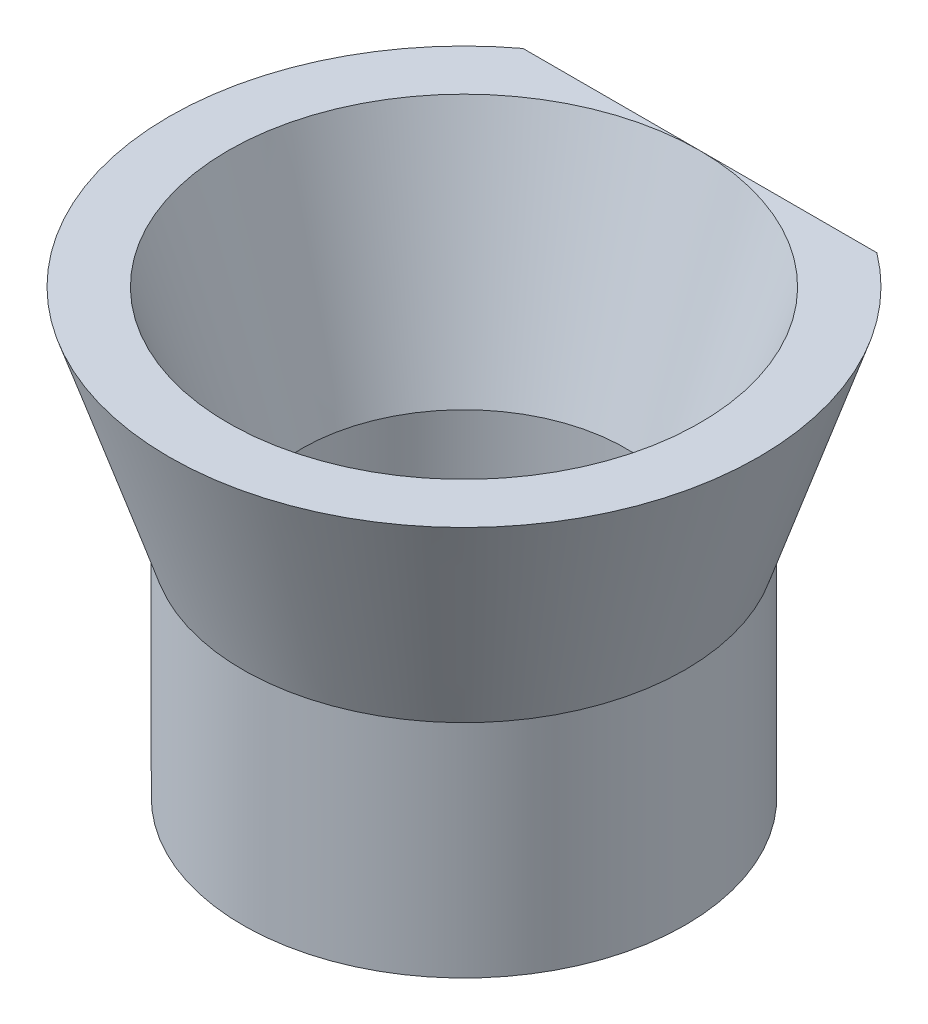
ISO-10303-21;
HEADER;
FILE_DESCRIPTION(('STEP AP214'),'2;1');
FILE_NAME('part.step','',(''),(''),'','','');
FILE_SCHEMA(('AUTOMOTIVE_DESIGN { 1 0 10303 214 1 1 1 1 }'));
ENDSEC;
DATA;
#1=APPLICATION_CONTEXT('core data for automotive mechanical design processes');
#2=APPLICATION_PROTOCOL_DEFINITION('international standard','automotive_design',2000,#1);
#3=PRODUCT_CONTEXT('',#1,'mechanical');
#4=PRODUCT('Part','Part','',(#3));
#5=PRODUCT_RELATED_PRODUCT_CATEGORY('part','',(#4));
#6=PRODUCT_DEFINITION_FORMATION('','',#4);
#7=PRODUCT_DEFINITION_CONTEXT('part definition',#1,'design');
#8=PRODUCT_DEFINITION('design','',#6,#7);
#9=PRODUCT_DEFINITION_SHAPE('','',#8);
#10=(LENGTH_UNIT() NAMED_UNIT(*) SI_UNIT(.MILLI.,.METRE.));
#11=(NAMED_UNIT(*) PLANE_ANGLE_UNIT() SI_UNIT($,.RADIAN.));
#12=(NAMED_UNIT(*) SI_UNIT($,.STERADIAN.) SOLID_ANGLE_UNIT());
#13=UNCERTAINTY_MEASURE_WITH_UNIT(LENGTH_MEASURE(1.E-05),#10,'distance_accuracy_value','');
#14=(GEOMETRIC_REPRESENTATION_CONTEXT(3) GLOBAL_UNCERTAINTY_ASSIGNED_CONTEXT((#13)) GLOBAL_UNIT_ASSIGNED_CONTEXT((#10,
#11,#12)) REPRESENTATION_CONTEXT('',''));
#15=CARTESIAN_POINT('',(0.,0.,0.));
#16=DIRECTION('',(0.,0.,1.));
#17=DIRECTION('',(1.,0.,0.));
#18=AXIS2_PLACEMENT_3D('',#15,#16,#17);
#19=CARTESIAN_POINT('',(0.,7.5,0.));
#20=DIRECTION('',(0.,1.,0.));
#21=DIRECTION('',(-1.,0.,0.));
#22=AXIS2_PLACEMENT_3D('',#19,#20,#21);
#23=CONICAL_SURFACE('',#22,10.,0.321750554396642);
#24=CARTESIAN_POINT('',(-9.24454303567789,14.1763436488223,-8.));
#25=CARTESIAN_POINT('',(-9.10569477276953,13.8613954725508,-8.));
#26=CARTESIAN_POINT('',(-8.96574609865972,13.5469287509722,-8.));
#27=CARTESIAN_POINT('',(-8.68329380641064,12.9191295276742,-8.));
#28=CARTESIAN_POINT('',(-8.54079008119043,12.6057970741559,-8.));
#29=CARTESIAN_POINT('',(-8.2526980260246,11.980057705734,-8.));
#30=CARTESIAN_POINT('',(-8.10710592677667,11.6676525236571,-8.));
#31=CARTESIAN_POINT('',(-7.81257371012224,11.0444276218861,-8.));
#32=CARTESIAN_POINT('',(-7.6636336387795,10.7336078804504,-8.));
#33=CARTESIAN_POINT('',(-7.35832769249353,10.1066065651362,-8.));
#34=CARTESIAN_POINT('',(-7.2018696027832,9.79046980971064,-8.));
#35=CARTESIAN_POINT('',(-6.88414504074487,9.16062304097392,-8.));
#36=CARTESIAN_POINT('',(-6.72287865045157,8.84691298637559,-8.));
#37=CARTESIAN_POINT('',(-6.39468770628505,8.22268443592128,-8.));
#38=CARTESIAN_POINT('',(-6.22776639834812,7.91216423814771,-8.));
#39=CARTESIAN_POINT('',(-5.88696278138132,7.29497792699961,-8.));
#40=CARTESIAN_POINT('',(-5.71308093553065,6.98831155895585,-8.));
#41=CARTESIAN_POINT('',(-5.35432333661414,6.37594889211449,-8.));
#42=CARTESIAN_POINT('',(-5.16933183563973,6.07032015376405,-8.));
#43=CARTESIAN_POINT('',(-4.78804370061161,5.46589785851707,-8.));
#44=CARTESIAN_POINT('',(-4.5917413865298,5.16710784296969,-8.));
#45=CARTESIAN_POINT('',(-4.28674636930607,4.72710391499398,-8.));
#46=CARTESIAN_POINT('',(-4.1835427470974,4.58208325643538,-8.));
#47=CARTESIAN_POINT('',(-3.97294022781535,4.29512835185492,-8.));
#48=CARTESIAN_POINT('',(-3.86554172478353,4.15319381788171,-8.));
#49=CARTESIAN_POINT('',(-3.64595793579181,3.87324906006634,-8.));
#50=CARTESIAN_POINT('',(-3.53377661025079,3.73523574122914,-8.));
#51=CARTESIAN_POINT('',(-3.30374029436852,3.46404334126958,-8.));
#52=CARTESIAN_POINT('',(-3.1858866240236,3.33086314797535,-8.));
#53=CARTESIAN_POINT('',(-2.96323190356762,3.09191235624022,-8.));
#54=CARTESIAN_POINT('',(-2.85943295784345,2.9852114662485,-8.));
#55=CARTESIAN_POINT('',(-2.64642192748903,2.77727411204413,-8.));
#56=CARTESIAN_POINT('',(-2.53720869788133,2.67603881319632,-8.));
#57=CARTESIAN_POINT('',(-2.31280525663956,2.48075252932649,-8.));
#58=CARTESIAN_POINT('',(-2.19762543900272,2.38668971246759,-8.));
#59=CARTESIAN_POINT('',(-1.96042227625798,2.20770762245108,-8.));
#60=CARTESIAN_POINT('',(-1.83840290507046,2.12278312180526,-8.));
#61=CARTESIAN_POINT('',(-1.5558966618511,1.94536491447872,-8.));
#62=CARTESIAN_POINT('',(-1.3933145495631,1.8561224577266,-8.));
#63=CARTESIAN_POINT('',(-1.05649022012242,1.70326267655866,-8.));
#64=CARTESIAN_POINT('',(-0.882270892839967,1.63959668027351,-8.));
#65=CARTESIAN_POINT('',(-0.554345281722239,1.55342085810759,-8.));
#66=CARTESIAN_POINT('',(-0.401995129495038,1.5258548449162,-8.));
#67=CARTESIAN_POINT('',(-0.0948068607246134,1.49727821843598,-8.));
#68=CARTESIAN_POINT('',(0.0600299395169995,1.49625399066451,-8.));
#69=CARTESIAN_POINT('',(0.367303142382071,1.5208629840155,-8.));
#70=CARTESIAN_POINT('',(0.51974234350439,1.54646235541336,-8.));
#71=CARTESIAN_POINT('',(0.818631422466707,1.6211740628739,-8.));
#72=CARTESIAN_POINT('',(0.96507738250549,1.67030152100824,-8.));
#73=CARTESIAN_POINT('',(1.32953022972107,1.82022121071207,-8.));
#74=CARTESIAN_POINT('',(1.54193510338091,1.93454807823632,-8.));
#75=CARTESIAN_POINT('',(1.84567955273147,2.12864263840525,-8.));
#76=CARTESIAN_POINT('',(1.94465324288413,2.19728556141693,-8.));
#77=CARTESIAN_POINT('',(2.13804565733174,2.3407389514385,-8.));
#78=CARTESIAN_POINT('',(2.23246523898747,2.4155482503201,-8.));
#79=CARTESIAN_POINT('',(2.44925759013744,2.59703077177536,-8.));
#80=CARTESIAN_POINT('',(2.56992011587711,2.70573113445258,-8.));
#81=CARTESIAN_POINT('',(2.80470570648837,2.93002129920439,-8.));
#82=CARTESIAN_POINT('',(2.91882577723235,3.04561420702878,-8.));
#83=CARTESIAN_POINT('',(3.14157446411835,3.28231249538075,-8.));
#84=CARTESIAN_POINT('',(3.25019350422911,3.40342683528697,-8.));
#85=CARTESIAN_POINT('',(3.46253605350942,3.64987894818479,-8.));
#86=CARTESIAN_POINT('',(3.56625895704296,3.77521724039598,-8.));
#87=CARTESIAN_POINT('',(3.77072633037294,4.0308635305577,-8.));
#88=CARTESIAN_POINT('',(3.87141745814981,4.16121403433047,-8.));
#89=CARTESIAN_POINT('',(4.06902124255324,4.42474588789625,-8.));
#90=CARTESIAN_POINT('',(4.16593377228471,4.5579273325279,-8.));
#91=CARTESIAN_POINT('',(4.35634109091726,4.82646858707353,-8.));
#92=CARTESIAN_POINT('',(4.44983979692935,4.96182562612383,-8.));
#93=CARTESIAN_POINT('',(4.63392697300001,5.23449099315925,-8.));
#94=CARTESIAN_POINT('',(4.72451555687136,5.37179924453019,-8.));
#95=CARTESIAN_POINT('',(5.02283771914524,5.83320152344906,-8.));
#96=CARTESIAN_POINT('',(5.22485610260052,6.16099650651995,-8.));
#97=CARTESIAN_POINT('',(5.6181730171291,6.82297994202042,-8.));
#98=CARTESIAN_POINT('',(5.80946932793764,7.15716969956537,-8.));
#99=CARTESIAN_POINT('',(6.18366838310789,7.83048044152699,-8.));
#100=CARTESIAN_POINT('',(6.36656569032789,8.16960443821652,-8.));
#101=CARTESIAN_POINT('',(6.72547874559801,8.85147784372403,-8.));
#102=CARTESIAN_POINT('',(6.90149421320207,9.19422739956773,-8.));
#103=CARTESIAN_POINT('',(7.24844897335354,9.88375656077994,-8.));
#104=CARTESIAN_POINT('',(7.41936873405891,10.2305459700732,-8.));
#105=CARTESIAN_POINT('',(7.75643942813245,10.9264368840752,-8.));
#106=CARTESIAN_POINT('',(7.9225902814056,11.2755384274959,-8.));
#107=CARTESIAN_POINT('',(8.25078773713447,11.975493863186,-8.));
#108=CARTESIAN_POINT('',(8.41283593898465,12.3263470066957,-8.));
#109=CARTESIAN_POINT('',(8.73347450690632,13.0296311128299,-8.));
#110=CARTESIAN_POINT('',(8.89206484099753,13.3820620900107,-8.));
#111=CARTESIAN_POINT('',(9.32640955085121,14.3582813360421,-8.));
#112=CARTESIAN_POINT('',(9.59901379062969,14.9834714097472,-8.));
#113=CARTESIAN_POINT('',(10.136932199975,16.2370512693405,-8.));
#114=CARTESIAN_POINT('',(10.4022455520955,16.8654414047296,-8.));
#115=CARTESIAN_POINT('',(10.9251864226981,18.1203960310083,-8.));
#116=CARTESIAN_POINT('',(11.182853930986,18.7469438890344,-8.));
#117=CARTESIAN_POINT('',(11.6933110903614,20.0019088420986,-8.));
#118=CARTESIAN_POINT('',(11.9461015108248,20.6303256239544,-8.));
#119=CARTESIAN_POINT('',(12.1969662905944,21.2595004569873,-8.));
#120=B_SPLINE_CURVE_WITH_KNOTS('',3,(#24,#25,#26,#27,#28,#29,#30,#31,#32,#33,#34,#35,#36,#37,
#38,#39,#40,#41,#42,#43,#44,#45,#46,#47,#48,#49,#50,#51,#52,#53,#54,#55,#56,#57,#58,#59,#60,#61,
#62,#63,#64,#65,#66,#67,#68,#69,#70,#71,#72,#73,#74,#75,#76,#77,#78,#79,#80,#81,#82,#83,#84,#85,
#86,#87,#88,#89,#90,#91,#92,#93,#94,#95,#96,#97,#98,#99,#100,#101,#102,#103,#104,#105,#106,#107,
#108,#109,#110,#111,#112,#113,#114,#115,#116,#117,#118,#119),.UNSPECIFIED.,.F.,.F.,(4,2,2,2,2,2,
2,2,2,2,2,2,2,2,2,2,2,2,2,2,2,2,2,2,2,2,2,2,2,2,2,2,2,2,2,2,2,2,2,2,2,2,2,2,2,2,2,4),(0.,
1.03259223507195,2.06522784720635,3.09920594174419,4.13316981878445,5.19133890247632,
6.24948994300096,7.30704356417434,8.364526928532,9.4361225191102,10.5082610112992,
11.0421846361279,11.5760582274731,12.1094980187678,12.642814269292,13.0892330437296,
13.5357466299894,13.9815069470482,14.4270109001181,14.981769417261,15.5354671732817,
15.9978398083941,16.4599752669641,16.9215238756316,17.3833695317037,18.1025979938421,
18.4638165253482,18.8249667859394,19.3118295031517,19.7989132810728,20.2868177054436,
20.7747823246811,21.2688381694371,21.7629105915998,22.256397045859,22.7498641766649,
23.9046896849906,25.0597534510701,26.2155547068345,27.3714030143774,28.5312250322093,
29.691066518161,30.850448658344,32.0098415165927,34.0558889339858,36.102164823681,
38.1345289344762,40.1665697677467),.UNSPECIFIED.);
#121=CARTESIAN_POINT('',(6.,7.5,-8.));
#122=VERTEX_POINT('',#121);
#123=CARTESIAN_POINT('',(-6.,7.5,-8.));
#124=VERTEX_POINT('',#123);
#125=EDGE_CURVE('E51',#122,#124,#120,.F.);
#126=ORIENTED_EDGE('',*,*,#125,.F.);
#127=CARTESIAN_POINT('',(0.,7.5,0.));
#128=DIRECTION('',(0.,1.,0.));
#129=DIRECTION('',(-1.,0.,0.));
#130=AXIS2_PLACEMENT_3D('',#127,#128,#129);
#131=CIRCLE('',#130,10.);
#132=EDGE_CURVE('E61',#124,#122,#131,.T.);
#133=ORIENTED_EDGE('',*,*,#132,.F.);
#134=EDGE_LOOP('',(#126,#133));
#135=FACE_BOUND('',#134,.T.);
#136=CARTESIAN_POINT('',(0.,0.,0.));
#137=DIRECTION('',(0.,-1.,0.));
#138=DIRECTION('',(1.,0.,0.));
#139=AXIS2_PLACEMENT_3D('',#136,#137,#138);
#140=CIRCLE('',#139,7.5);
#141=CARTESIAN_POINT('',(7.5,0.,0.));
#142=VERTEX_POINT('',#141);
#143=EDGE_CURVE('E70',#142,#142,#140,.T.);
#144=ORIENTED_EDGE('',*,*,#143,.F.);
#145=EDGE_LOOP('',(#144));
#146=FACE_BOUND('',#145,.T.);
#147=ADVANCED_FACE('F33',(#135,#146),#23,.T.);
#148=CARTESIAN_POINT('',(0.,0.,0.));
#149=DIRECTION('',(0.,1.,0.));
#150=DIRECTION('',(-1.,0.,0.));
#151=AXIS2_PLACEMENT_3D('',#148,#149,#150);
#152=CONICAL_SURFACE('',#151,5.5,0.321750554396642);
#153=CARTESIAN_POINT('',(0.,7.5,0.));
#154=DIRECTION('',(0.,1.,0.));
#155=DIRECTION('',(-1.,0.,0.));
#156=AXIS2_PLACEMENT_3D('',#153,#154,#155);
#157=CIRCLE('',#156,8.);
#158=CARTESIAN_POINT('',(0.,7.5,-8.));
#159=VERTEX_POINT('',#158);
#160=EDGE_CURVE('E63',#159,#159,#157,.T.);
#161=ORIENTED_EDGE('',*,*,#160,.T.);
#162=EDGE_LOOP('',(#161));
#163=FACE_BOUND('',#162,.T.);
#164=CARTESIAN_POINT('',(0.,0.,0.));
#165=DIRECTION('',(0.,1.,0.));
#166=DIRECTION('',(-1.,0.,0.));
#167=AXIS2_PLACEMENT_3D('',#164,#165,#166);
#168=CIRCLE('',#167,5.5);
#169=CARTESIAN_POINT('',(-5.5,0.,0.));
#170=VERTEX_POINT('',#169);
#171=EDGE_CURVE('E67',#170,#170,#168,.T.);
#172=ORIENTED_EDGE('',*,*,#171,.F.);
#173=EDGE_LOOP('',(#172));
#174=FACE_BOUND('',#173,.T.);
#175=ADVANCED_FACE('F78',(#163,#174),#152,.F.);
#176=CARTESIAN_POINT('',(-8.,7.5,0.));
#177=DIRECTION('',(0.,1.,0.));
#178=DIRECTION('',(-1.,0.,0.));
#179=AXIS2_PLACEMENT_3D('',#176,#177,#178);
#180=PLANE('',#179);
#181=DIRECTION('',(1.,0.,0.));
#182=VECTOR('',#181,1.);
#183=CARTESIAN_POINT('',(-8.,7.5,-8.));
#184=LINE('',#183,#182);
#185=EDGE_CURVE('E11',#124,#159,#184,.T.);
#186=ORIENTED_EDGE('',*,*,#185,.F.);
#187=ORIENTED_EDGE('',*,*,#132,.T.);
#188=EDGE_CURVE('E37',#159,#122,#184,.T.);
#189=ORIENTED_EDGE('',*,*,#188,.F.);
#190=ORIENTED_EDGE('',*,*,#160,.F.);
#191=EDGE_LOOP('',(#186,#187,#189,#190));
#192=FACE_BOUND('',#191,.T.);
#193=ADVANCED_FACE('F60',(#192),#180,.T.);
#194=CARTESIAN_POINT('',(0.,-7.5,0.));
#195=DIRECTION('',(0.,-1.,0.));
#196=DIRECTION('',(1.,0.,0.));
#197=AXIS2_PLACEMENT_3D('',#194,#195,#196);
#198=PLANE('',#197);
#199=CARTESIAN_POINT('',(0.,-7.5,0.));
#200=DIRECTION('',(0.,-1.,0.));
#201=DIRECTION('',(1.,0.,0.));
#202=AXIS2_PLACEMENT_3D('',#199,#200,#201);
#203=CIRCLE('',#202,7.5);
#204=CARTESIAN_POINT('',(7.5,-7.5,0.));
#205=VERTEX_POINT('',#204);
#206=EDGE_CURVE('E65',#205,#205,#203,.T.);
#207=ORIENTED_EDGE('',*,*,#206,.T.);
#208=EDGE_LOOP('',(#207));
#209=FACE_BOUND('',#208,.T.);
#210=CARTESIAN_POINT('',(0.,-7.5,0.));
#211=DIRECTION('',(0.,-1.,0.));
#212=DIRECTION('',(1.,0.,0.));
#213=AXIS2_PLACEMENT_3D('',#210,#211,#212);
#214=CIRCLE('',#213,5.5);
#215=CARTESIAN_POINT('',(5.5,-7.5,0.));
#216=VERTEX_POINT('',#215);
#217=EDGE_CURVE('E56',#216,#216,#214,.T.);
#218=ORIENTED_EDGE('',*,*,#217,.F.);
#219=EDGE_LOOP('',(#218));
#220=FACE_BOUND('',#219,.T.);
#221=ADVANCED_FACE('F85',(#209,#220),#198,.T.);
#222=CARTESIAN_POINT('',(0.,-7.5,0.));
#223=DIRECTION('',(0.,1.,0.));
#224=DIRECTION('',(-1.,0.,0.));
#225=AXIS2_PLACEMENT_3D('',#222,#223,#224);
#226=CYLINDRICAL_SURFACE('',#225,7.5);
#227=ORIENTED_EDGE('',*,*,#206,.F.);
#228=EDGE_LOOP('',(#227));
#229=FACE_BOUND('',#228,.T.);
#230=ORIENTED_EDGE('',*,*,#143,.T.);
#231=EDGE_LOOP('',(#230));
#232=FACE_BOUND('',#231,.T.);
#233=ADVANCED_FACE('F88',(#229,#232),#226,.T.);
#234=CARTESIAN_POINT('',(0.,-7.5,0.));
#235=DIRECTION('',(0.,1.,0.));
#236=DIRECTION('',(-1.,0.,0.));
#237=AXIS2_PLACEMENT_3D('',#234,#235,#236);
#238=CYLINDRICAL_SURFACE('',#237,5.5);
#239=ORIENTED_EDGE('',*,*,#217,.T.);
#240=EDGE_LOOP('',(#239));
#241=FACE_BOUND('',#240,.T.);
#242=ORIENTED_EDGE('',*,*,#171,.T.);
#243=EDGE_LOOP('',(#242));
#244=FACE_BOUND('',#243,.T.);
#245=ADVANCED_FACE('F76',(#241,#244),#238,.F.);
#246=CARTESIAN_POINT('',(-7.30079800636015,-12.,-8.));
#247=DIRECTION('',(0.,0.,1.));
#248=DIRECTION('',(1.,0.,0.));
#249=AXIS2_PLACEMENT_3D('',#246,#247,#248);
#250=PLANE('',#249);
#251=ORIENTED_EDGE('',*,*,#125,.T.);
#252=ORIENTED_EDGE('',*,*,#185,.T.);
#253=ORIENTED_EDGE('',*,*,#188,.T.);
#254=EDGE_LOOP('',(#251,#252,#253));
#255=FACE_BOUND('',#254,.T.);
#256=ADVANCED_FACE('F52',(#255),#250,.F.);
#257=CLOSED_SHELL('',(#147,#175,#193,#221,#233,#245,#256));
#258=MANIFOLD_SOLID_BREP('B2',#257);
#259=ADVANCED_BREP_SHAPE_REPRESENTATION('',(#18,#258),#14);
#260=SHAPE_DEFINITION_REPRESENTATION(#9,#259);
ENDSEC;
END-ISO-10303-21;
